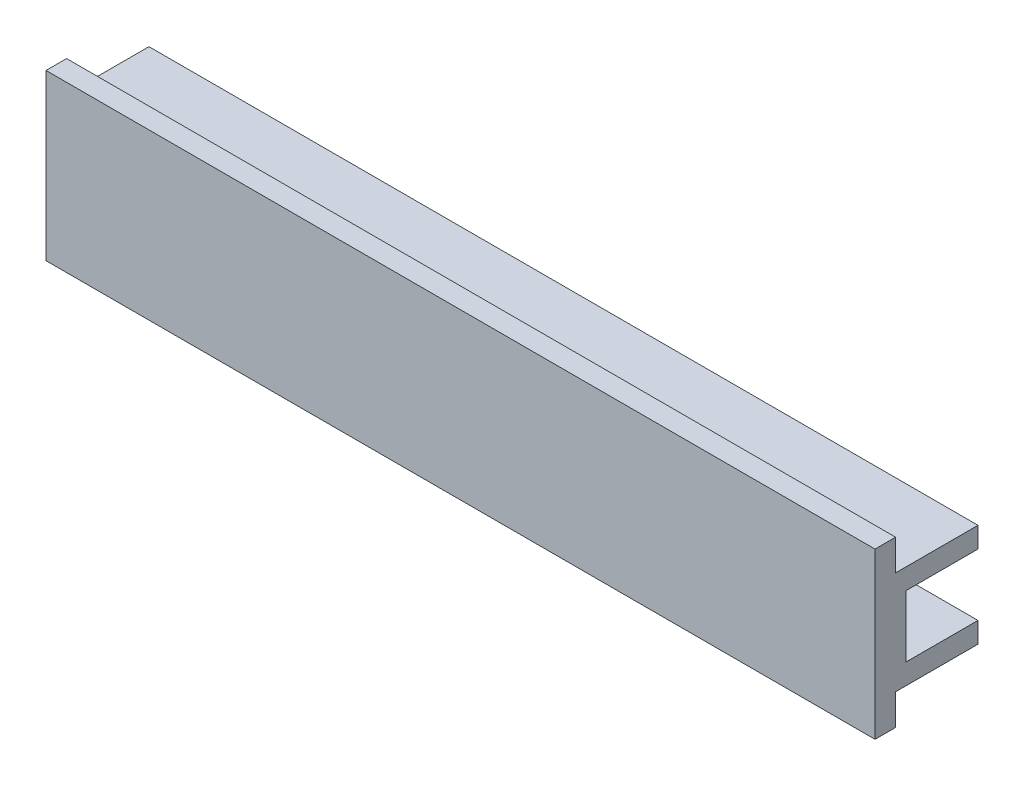
ISO-10303-21;
HEADER;
FILE_DESCRIPTION(('STEP AP214'),'2;1');
FILE_NAME('part.step','',(''),(''),'','','');
FILE_SCHEMA(('AUTOMOTIVE_DESIGN { 1 0 10303 214 1 1 1 1 }'));
ENDSEC;
DATA;
#1=APPLICATION_CONTEXT('core data for automotive mechanical design processes');
#2=APPLICATION_PROTOCOL_DEFINITION('international standard','automotive_design',2000,#1);
#3=PRODUCT_CONTEXT('',#1,'mechanical');
#4=PRODUCT('Part','Part','',(#3));
#5=PRODUCT_RELATED_PRODUCT_CATEGORY('part','',(#4));
#6=PRODUCT_DEFINITION_FORMATION('','',#4);
#7=PRODUCT_DEFINITION_CONTEXT('part definition',#1,'design');
#8=PRODUCT_DEFINITION('design','',#6,#7);
#9=PRODUCT_DEFINITION_SHAPE('','',#8);
#10=(LENGTH_UNIT() NAMED_UNIT(*) SI_UNIT(.MILLI.,.METRE.));
#11=(NAMED_UNIT(*) PLANE_ANGLE_UNIT() SI_UNIT($,.RADIAN.));
#12=(NAMED_UNIT(*) SI_UNIT($,.STERADIAN.) SOLID_ANGLE_UNIT());
#13=UNCERTAINTY_MEASURE_WITH_UNIT(LENGTH_MEASURE(1.E-05),#10,'distance_accuracy_value','');
#14=(GEOMETRIC_REPRESENTATION_CONTEXT(3) GLOBAL_UNCERTAINTY_ASSIGNED_CONTEXT((#13)) GLOBAL_UNIT_ASSIGNED_CONTEXT((#10,
#11,#12)) REPRESENTATION_CONTEXT('',''));
#15=CARTESIAN_POINT('',(0.,0.,0.));
#16=DIRECTION('',(0.,0.,1.));
#17=DIRECTION('',(1.,0.,0.));
#18=AXIS2_PLACEMENT_3D('',#15,#16,#17);
#19=CARTESIAN_POINT('',(40.25,8.,5.));
#20=DIRECTION('',(0.,0.,-1.));
#21=DIRECTION('',(-1.,0.,0.));
#22=AXIS2_PLACEMENT_3D('',#19,#20,#21);
#23=PLANE('',#22);
#24=DIRECTION('',(0.,-1.,0.));
#25=VECTOR('',#24,1.);
#26=CARTESIAN_POINT('',(-40.25,8.,5.));
#27=LINE('',#26,#25);
#28=CARTESIAN_POINT('',(-40.25,8.,5.));
#29=VERTEX_POINT('',#28);
#30=CARTESIAN_POINT('',(-40.25,-8.,5.));
#31=VERTEX_POINT('',#30);
#32=EDGE_CURVE('E150',#29,#31,#27,.T.);
#33=ORIENTED_EDGE('',*,*,#32,.T.);
#34=DIRECTION('',(-1.,0.,0.));
#35=VECTOR('',#34,1.);
#36=CARTESIAN_POINT('',(40.25,-8.,5.));
#37=LINE('',#36,#35);
#38=CARTESIAN_POINT('',(40.25,-8.,5.));
#39=VERTEX_POINT('',#38);
#40=EDGE_CURVE('E11',#39,#31,#37,.T.);
#41=ORIENTED_EDGE('',*,*,#40,.F.);
#42=DIRECTION('',(0.,-1.,0.));
#43=VECTOR('',#42,1.);
#44=CARTESIAN_POINT('',(40.25,8.,5.));
#45=LINE('',#44,#43);
#46=CARTESIAN_POINT('',(40.25,8.,5.));
#47=VERTEX_POINT('',#46);
#48=EDGE_CURVE('E172',#47,#39,#45,.T.);
#49=ORIENTED_EDGE('',*,*,#48,.F.);
#50=DIRECTION('',(-1.,0.,0.));
#51=VECTOR('',#50,1.);
#52=CARTESIAN_POINT('',(40.25,8.,5.));
#53=LINE('',#52,#51);
#54=EDGE_CURVE('E146',#47,#29,#53,.T.);
#55=ORIENTED_EDGE('',*,*,#54,.T.);
#56=EDGE_LOOP('',(#33,#41,#49,#55));
#57=FACE_BOUND('',#56,.T.);
#58=ADVANCED_FACE('F32',(#57),#23,.F.);
#59=CARTESIAN_POINT('',(40.25,-8.,5.));
#60=DIRECTION('',(0.,1.,0.));
#61=DIRECTION('',(0.,0.,1.));
#62=AXIS2_PLACEMENT_3D('',#59,#60,#61);
#63=PLANE('',#62);
#64=DIRECTION('',(0.,0.,-1.));
#65=VECTOR('',#64,1.);
#66=CARTESIAN_POINT('',(-40.25,-8.,5.));
#67=LINE('',#66,#65);
#68=CARTESIAN_POINT('',(-40.25,-8.,3.));
#69=VERTEX_POINT('',#68);
#70=EDGE_CURVE('E153',#31,#69,#67,.T.);
#71=ORIENTED_EDGE('',*,*,#70,.T.);
#72=DIRECTION('',(-1.,0.,0.));
#73=VECTOR('',#72,1.);
#74=CARTESIAN_POINT('',(40.25,-8.,3.));
#75=LINE('',#74,#73);
#76=CARTESIAN_POINT('',(40.25,-8.,3.));
#77=VERTEX_POINT('',#76);
#78=EDGE_CURVE('E40',#77,#69,#75,.T.);
#79=ORIENTED_EDGE('',*,*,#78,.F.);
#80=DIRECTION('',(0.,0.,-1.));
#81=VECTOR('',#80,1.);
#82=CARTESIAN_POINT('',(40.25,-8.,5.));
#83=LINE('',#82,#81);
#84=EDGE_CURVE('E98',#39,#77,#83,.T.);
#85=ORIENTED_EDGE('',*,*,#84,.F.);
#86=ORIENTED_EDGE('',*,*,#40,.T.);
#87=EDGE_LOOP('',(#71,#79,#85,#86));
#88=FACE_BOUND('',#87,.T.);
#89=ADVANCED_FACE('F251',(#88),#63,.F.);
#90=CARTESIAN_POINT('',(40.25,-5.,3.));
#91=DIRECTION('',(0.,0.,1.));
#92=DIRECTION('',(0.,-1.,0.));
#93=AXIS2_PLACEMENT_3D('',#90,#91,#92);
#94=PLANE('',#93);
#95=DIRECTION('',(0.,1.,0.));
#96=VECTOR('',#95,1.);
#97=CARTESIAN_POINT('',(-40.25,-5.,3.));
#98=LINE('',#97,#96);
#99=CARTESIAN_POINT('',(-40.25,-5.,3.));
#100=VERTEX_POINT('',#99);
#101=EDGE_CURVE('E156',#69,#100,#98,.T.);
#102=ORIENTED_EDGE('',*,*,#101,.T.);
#103=DIRECTION('',(-1.,0.,0.));
#104=VECTOR('',#103,1.);
#105=CARTESIAN_POINT('',(40.25,-5.,3.));
#106=LINE('',#105,#104);
#107=CARTESIAN_POINT('',(40.25,-5.,3.));
#108=VERTEX_POINT('',#107);
#109=EDGE_CURVE('E191',#108,#100,#106,.T.);
#110=ORIENTED_EDGE('',*,*,#109,.F.);
#111=DIRECTION('',(0.,1.,0.));
#112=VECTOR('',#111,1.);
#113=CARTESIAN_POINT('',(40.25,-5.,3.));
#114=LINE('',#113,#112);
#115=EDGE_CURVE('E199',#77,#108,#114,.T.);
#116=ORIENTED_EDGE('',*,*,#115,.F.);
#117=ORIENTED_EDGE('',*,*,#78,.T.);
#118=EDGE_LOOP('',(#102,#110,#116,#117));
#119=FACE_BOUND('',#118,.T.);
#120=ADVANCED_FACE('F197',(#119),#94,.F.);
#121=CARTESIAN_POINT('',(40.25,-5.,-5.));
#122=DIRECTION('',(0.,1.,0.));
#123=DIRECTION('',(0.,0.,1.));
#124=AXIS2_PLACEMENT_3D('',#121,#122,#123);
#125=PLANE('',#124);
#126=DIRECTION('',(0.,0.,-1.));
#127=VECTOR('',#126,1.);
#128=CARTESIAN_POINT('',(-40.25,-5.,-5.));
#129=LINE('',#128,#127);
#130=CARTESIAN_POINT('',(-40.25,-5.,-5.));
#131=VERTEX_POINT('',#130);
#132=EDGE_CURVE('E158',#100,#131,#129,.T.);
#133=ORIENTED_EDGE('',*,*,#132,.T.);
#134=DIRECTION('',(-1.,0.,0.));
#135=VECTOR('',#134,1.);
#136=CARTESIAN_POINT('',(40.25,-5.,-5.));
#137=LINE('',#136,#135);
#138=CARTESIAN_POINT('',(40.25,-5.,-5.));
#139=VERTEX_POINT('',#138);
#140=EDGE_CURVE('E188',#139,#131,#137,.T.);
#141=ORIENTED_EDGE('',*,*,#140,.F.);
#142=DIRECTION('',(0.,0.,-1.));
#143=VECTOR('',#142,1.);
#144=CARTESIAN_POINT('',(40.25,-5.,-5.));
#145=LINE('',#144,#143);
#146=EDGE_CURVE('E218',#108,#139,#145,.T.);
#147=ORIENTED_EDGE('',*,*,#146,.F.);
#148=ORIENTED_EDGE('',*,*,#109,.T.);
#149=EDGE_LOOP('',(#133,#141,#147,#148));
#150=FACE_BOUND('',#149,.T.);
#151=ADVANCED_FACE('F209',(#150),#125,.F.);
#152=CARTESIAN_POINT('',(40.25,-3.,-5.));
#153=DIRECTION('',(0.,0.,1.));
#154=DIRECTION('',(1.,0.,0.));
#155=AXIS2_PLACEMENT_3D('',#152,#153,#154);
#156=PLANE('',#155);
#157=DIRECTION('',(0.,1.,0.));
#158=VECTOR('',#157,1.);
#159=CARTESIAN_POINT('',(-40.25,-3.,-5.));
#160=LINE('',#159,#158);
#161=CARTESIAN_POINT('',(-40.25,-3.,-5.));
#162=VERTEX_POINT('',#161);
#163=EDGE_CURVE('E160',#131,#162,#160,.T.);
#164=ORIENTED_EDGE('',*,*,#163,.T.);
#165=DIRECTION('',(-1.,0.,0.));
#166=VECTOR('',#165,1.);
#167=CARTESIAN_POINT('',(40.25,-3.,-5.));
#168=LINE('',#167,#166);
#169=CARTESIAN_POINT('',(40.25,-3.,-5.));
#170=VERTEX_POINT('',#169);
#171=EDGE_CURVE('E185',#170,#162,#168,.T.);
#172=ORIENTED_EDGE('',*,*,#171,.F.);
#173=DIRECTION('',(0.,1.,0.));
#174=VECTOR('',#173,1.);
#175=CARTESIAN_POINT('',(40.25,-3.,-5.));
#176=LINE('',#175,#174);
#177=EDGE_CURVE('E215',#139,#170,#176,.T.);
#178=ORIENTED_EDGE('',*,*,#177,.F.);
#179=ORIENTED_EDGE('',*,*,#140,.T.);
#180=EDGE_LOOP('',(#164,#172,#178,#179));
#181=FACE_BOUND('',#180,.T.);
#182=ADVANCED_FACE('F213',(#181),#156,.F.);
#183=CARTESIAN_POINT('',(40.25,-3.,2.));
#184=DIRECTION('',(0.,-1.,0.));
#185=DIRECTION('',(0.,0.,-1.));
#186=AXIS2_PLACEMENT_3D('',#183,#184,#185);
#187=PLANE('',#186);
#188=DIRECTION('',(0.,0.,1.));
#189=VECTOR('',#188,1.);
#190=CARTESIAN_POINT('',(-40.25,-3.,2.));
#191=LINE('',#190,#189);
#192=CARTESIAN_POINT('',(-40.25,-3.,3.));
#193=VERTEX_POINT('',#192);
#194=EDGE_CURVE('E162',#162,#193,#191,.T.);
#195=ORIENTED_EDGE('',*,*,#194,.T.);
#196=DIRECTION('',(-1.,0.,0.));
#197=VECTOR('',#196,1.);
#198=CARTESIAN_POINT('',(-18.25,-3.,3.));
#199=LINE('',#198,#197);
#200=CARTESIAN_POINT('',(-18.25,-3.,3.));
#201=VERTEX_POINT('',#200);
#202=EDGE_CURVE('E363',#201,#193,#199,.T.);
#203=ORIENTED_EDGE('',*,*,#202,.F.);
#204=DIRECTION('',(0.,0.,1.));
#205=VECTOR('',#204,1.);
#206=CARTESIAN_POINT('',(-18.25,-3.,3.));
#207=LINE('',#206,#205);
#208=CARTESIAN_POINT('',(-18.25,-3.,2.));
#209=VERTEX_POINT('',#208);
#210=EDGE_CURVE('E364',#209,#201,#207,.T.);
#211=ORIENTED_EDGE('',*,*,#210,.F.);
#212=DIRECTION('',(-1.,0.,0.));
#213=VECTOR('',#212,1.);
#214=CARTESIAN_POINT('',(40.25,-3.,2.));
#215=LINE('',#214,#213);
#216=CARTESIAN_POINT('',(40.25,-3.,2.));
#217=VERTEX_POINT('',#216);
#218=EDGE_CURVE('E182',#217,#209,#215,.T.);
#219=ORIENTED_EDGE('',*,*,#218,.F.);
#220=DIRECTION('',(0.,0.,1.));
#221=VECTOR('',#220,1.);
#222=CARTESIAN_POINT('',(40.25,-3.,2.));
#223=LINE('',#222,#221);
#224=EDGE_CURVE('E217',#170,#217,#223,.T.);
#225=ORIENTED_EDGE('',*,*,#224,.F.);
#226=ORIENTED_EDGE('',*,*,#171,.T.);
#227=EDGE_LOOP('',(#195,#203,#211,#219,#225,#226));
#228=FACE_BOUND('',#227,.T.);
#229=ADVANCED_FACE('F264',(#228),#187,.F.);
#230=CARTESIAN_POINT('',(40.25,3.,2.));
#231=DIRECTION('',(0.,0.,1.));
#232=DIRECTION('',(0.,-1.,0.));
#233=AXIS2_PLACEMENT_3D('',#230,#231,#232);
#234=PLANE('',#233);
#235=ORIENTED_EDGE('',*,*,#218,.T.);
#236=CARTESIAN_POINT('',(-18.25,0.,2.));
#237=DIRECTION('',(0.,0.,-1.));
#238=DIRECTION('',(0.,1.,0.));
#239=AXIS2_PLACEMENT_3D('',#236,#237,#238);
#240=CIRCLE('',#239,3.);
#241=CARTESIAN_POINT('',(-18.25,3.,2.));
#242=VERTEX_POINT('',#241);
#243=EDGE_CURVE('E356',#242,#209,#240,.T.);
#244=ORIENTED_EDGE('',*,*,#243,.F.);
#245=DIRECTION('',(-1.,0.,0.));
#246=VECTOR('',#245,1.);
#247=CARTESIAN_POINT('',(40.25,3.,2.));
#248=LINE('',#247,#246);
#249=CARTESIAN_POINT('',(40.25,3.,2.));
#250=VERTEX_POINT('',#249);
#251=EDGE_CURVE('E179',#250,#242,#248,.T.);
#252=ORIENTED_EDGE('',*,*,#251,.F.);
#253=DIRECTION('',(0.,1.,0.));
#254=VECTOR('',#253,1.);
#255=CARTESIAN_POINT('',(40.25,3.,2.));
#256=LINE('',#255,#254);
#257=EDGE_CURVE('E220',#217,#250,#256,.T.);
#258=ORIENTED_EDGE('',*,*,#257,.F.);
#259=EDGE_LOOP('',(#235,#244,#252,#258));
#260=FACE_BOUND('',#259,.T.);
#261=ADVANCED_FACE('F267',(#260),#234,.F.);
#262=CARTESIAN_POINT('',(40.25,3.,-5.));
#263=DIRECTION('',(0.,1.,0.));
#264=DIRECTION('',(0.,0.,1.));
#265=AXIS2_PLACEMENT_3D('',#262,#263,#264);
#266=PLANE('',#265);
#267=DIRECTION('',(0.,0.,-1.));
#268=VECTOR('',#267,1.);
#269=CARTESIAN_POINT('',(-40.25,3.,-5.));
#270=LINE('',#269,#268);
#271=CARTESIAN_POINT('',(-40.25,3.,3.));
#272=VERTEX_POINT('',#271);
#273=CARTESIAN_POINT('',(-40.25,3.,-5.));
#274=VERTEX_POINT('',#273);
#275=EDGE_CURVE('E165',#272,#274,#270,.T.);
#276=ORIENTED_EDGE('',*,*,#275,.T.);
#277=DIRECTION('',(-1.,0.,0.));
#278=VECTOR('',#277,1.);
#279=CARTESIAN_POINT('',(40.25,3.,-5.));
#280=LINE('',#279,#278);
#281=CARTESIAN_POINT('',(40.25,3.,-5.));
#282=VERTEX_POINT('',#281);
#283=EDGE_CURVE('E176',#282,#274,#280,.T.);
#284=ORIENTED_EDGE('',*,*,#283,.F.);
#285=DIRECTION('',(0.,0.,-1.));
#286=VECTOR('',#285,1.);
#287=CARTESIAN_POINT('',(40.25,3.,-5.));
#288=LINE('',#287,#286);
#289=EDGE_CURVE('E226',#250,#282,#288,.T.);
#290=ORIENTED_EDGE('',*,*,#289,.F.);
#291=ORIENTED_EDGE('',*,*,#251,.T.);
#292=DIRECTION('',(0.,0.,-1.));
#293=VECTOR('',#292,1.);
#294=CARTESIAN_POINT('',(-18.25,3.,2.));
#295=LINE('',#294,#293);
#296=CARTESIAN_POINT('',(-18.25,3.,3.));
#297=VERTEX_POINT('',#296);
#298=EDGE_CURVE('E352',#297,#242,#295,.T.);
#299=ORIENTED_EDGE('',*,*,#298,.F.);
#300=DIRECTION('',(-1.,0.,0.));
#301=VECTOR('',#300,1.);
#302=CARTESIAN_POINT('',(-18.25,3.,3.));
#303=LINE('',#302,#301);
#304=EDGE_CURVE('E154',#297,#272,#303,.T.);
#305=ORIENTED_EDGE('',*,*,#304,.T.);
#306=EDGE_LOOP('',(#276,#284,#290,#291,#299,#305));
#307=FACE_BOUND('',#306,.T.);
#308=ADVANCED_FACE('F232',(#307),#266,.F.);
#309=CARTESIAN_POINT('',(40.25,5.,-5.));
#310=DIRECTION('',(0.,0.,1.));
#311=DIRECTION('',(1.,0.,0.));
#312=AXIS2_PLACEMENT_3D('',#309,#310,#311);
#313=PLANE('',#312);
#314=DIRECTION('',(0.,1.,0.));
#315=VECTOR('',#314,1.);
#316=CARTESIAN_POINT('',(-40.25,5.,-5.));
#317=LINE('',#316,#315);
#318=CARTESIAN_POINT('',(-40.25,5.,-5.));
#319=VERTEX_POINT('',#318);
#320=EDGE_CURVE('E167',#274,#319,#317,.T.);
#321=ORIENTED_EDGE('',*,*,#320,.T.);
#322=DIRECTION('',(-1.,0.,0.));
#323=VECTOR('',#322,1.);
#324=CARTESIAN_POINT('',(40.25,5.,-5.));
#325=LINE('',#324,#323);
#326=CARTESIAN_POINT('',(40.25,5.,-5.));
#327=VERTEX_POINT('',#326);
#328=EDGE_CURVE('E141',#327,#319,#325,.T.);
#329=ORIENTED_EDGE('',*,*,#328,.F.);
#330=DIRECTION('',(0.,1.,0.));
#331=VECTOR('',#330,1.);
#332=CARTESIAN_POINT('',(40.25,5.,-5.));
#333=LINE('',#332,#331);
#334=EDGE_CURVE('E132',#282,#327,#333,.T.);
#335=ORIENTED_EDGE('',*,*,#334,.F.);
#336=ORIENTED_EDGE('',*,*,#283,.T.);
#337=EDGE_LOOP('',(#321,#329,#335,#336));
#338=FACE_BOUND('',#337,.T.);
#339=ADVANCED_FACE('F236',(#338),#313,.F.);
#340=CARTESIAN_POINT('',(40.25,5.,3.));
#341=DIRECTION('',(0.,-1.,0.));
#342=DIRECTION('',(0.,0.,-1.));
#343=AXIS2_PLACEMENT_3D('',#340,#341,#342);
#344=PLANE('',#343);
#345=DIRECTION('',(0.,0.,1.));
#346=VECTOR('',#345,1.);
#347=CARTESIAN_POINT('',(-40.25,5.,3.));
#348=LINE('',#347,#346);
#349=CARTESIAN_POINT('',(-40.25,5.,3.));
#350=VERTEX_POINT('',#349);
#351=EDGE_CURVE('E140',#319,#350,#348,.T.);
#352=ORIENTED_EDGE('',*,*,#351,.T.);
#353=DIRECTION('',(-1.,0.,0.));
#354=VECTOR('',#353,1.);
#355=CARTESIAN_POINT('',(40.25,5.,3.));
#356=LINE('',#355,#354);
#357=CARTESIAN_POINT('',(40.25,5.,3.));
#358=VERTEX_POINT('',#357);
#359=EDGE_CURVE('E137',#358,#350,#356,.T.);
#360=ORIENTED_EDGE('',*,*,#359,.F.);
#361=DIRECTION('',(0.,0.,1.));
#362=VECTOR('',#361,1.);
#363=CARTESIAN_POINT('',(40.25,5.,3.));
#364=LINE('',#363,#362);
#365=EDGE_CURVE('E126',#327,#358,#364,.T.);
#366=ORIENTED_EDGE('',*,*,#365,.F.);
#367=ORIENTED_EDGE('',*,*,#328,.T.);
#368=EDGE_LOOP('',(#352,#360,#366,#367));
#369=FACE_BOUND('',#368,.T.);
#370=ADVANCED_FACE('F138',(#369),#344,.F.);
#371=CARTESIAN_POINT('',(40.25,8.,3.));
#372=DIRECTION('',(0.,0.,1.));
#373=DIRECTION('',(0.,-1.,0.));
#374=AXIS2_PLACEMENT_3D('',#371,#372,#373);
#375=PLANE('',#374);
#376=DIRECTION('',(0.,1.,0.));
#377=VECTOR('',#376,1.);
#378=CARTESIAN_POINT('',(-40.25,8.,3.));
#379=LINE('',#378,#377);
#380=CARTESIAN_POINT('',(-40.25,8.,3.));
#381=VERTEX_POINT('',#380);
#382=EDGE_CURVE('E84',#350,#381,#379,.T.);
#383=ORIENTED_EDGE('',*,*,#382,.T.);
#384=DIRECTION('',(-1.,0.,0.));
#385=VECTOR('',#384,1.);
#386=CARTESIAN_POINT('',(40.25,8.,3.));
#387=LINE('',#386,#385);
#388=CARTESIAN_POINT('',(40.25,8.,3.));
#389=VERTEX_POINT('',#388);
#390=EDGE_CURVE('E142',#389,#381,#387,.T.);
#391=ORIENTED_EDGE('',*,*,#390,.F.);
#392=DIRECTION('',(0.,1.,0.));
#393=VECTOR('',#392,1.);
#394=CARTESIAN_POINT('',(40.25,8.,3.));
#395=LINE('',#394,#393);
#396=EDGE_CURVE('E130',#358,#389,#395,.T.);
#397=ORIENTED_EDGE('',*,*,#396,.F.);
#398=ORIENTED_EDGE('',*,*,#359,.T.);
#399=EDGE_LOOP('',(#383,#391,#397,#398));
#400=FACE_BOUND('',#399,.T.);
#401=ADVANCED_FACE('F144',(#400),#375,.F.);
#402=CARTESIAN_POINT('',(40.25,8.,5.));
#403=DIRECTION('',(0.,-1.,0.));
#404=DIRECTION('',(0.,0.,-1.));
#405=AXIS2_PLACEMENT_3D('',#402,#403,#404);
#406=PLANE('',#405);
#407=DIRECTION('',(0.,0.,1.));
#408=VECTOR('',#407,1.);
#409=CARTESIAN_POINT('',(-40.25,8.,5.));
#410=LINE('',#409,#408);
#411=EDGE_CURVE('E90',#381,#29,#410,.T.);
#412=ORIENTED_EDGE('',*,*,#411,.T.);
#413=ORIENTED_EDGE('',*,*,#54,.F.);
#414=DIRECTION('',(0.,0.,1.));
#415=VECTOR('',#414,1.);
#416=CARTESIAN_POINT('',(40.25,8.,5.));
#417=LINE('',#416,#415);
#418=EDGE_CURVE('E48',#389,#47,#417,.T.);
#419=ORIENTED_EDGE('',*,*,#418,.F.);
#420=ORIENTED_EDGE('',*,*,#390,.T.);
#421=EDGE_LOOP('',(#412,#413,#419,#420));
#422=FACE_BOUND('',#421,.T.);
#423=ADVANCED_FACE('F240',(#422),#406,.F.);
#424=CARTESIAN_POINT('',(40.25,-8.,5.));
#425=DIRECTION('',(1.,0.,0.));
#426=DIRECTION('',(0.,0.,-1.));
#427=AXIS2_PLACEMENT_3D('',#424,#425,#426);
#428=PLANE('',#427);
#429=ORIENTED_EDGE('',*,*,#48,.T.);
#430=ORIENTED_EDGE('',*,*,#84,.T.);
#431=ORIENTED_EDGE('',*,*,#115,.T.);
#432=ORIENTED_EDGE('',*,*,#146,.T.);
#433=ORIENTED_EDGE('',*,*,#177,.T.);
#434=ORIENTED_EDGE('',*,*,#224,.T.);
#435=ORIENTED_EDGE('',*,*,#257,.T.);
#436=ORIENTED_EDGE('',*,*,#289,.T.);
#437=ORIENTED_EDGE('',*,*,#334,.T.);
#438=ORIENTED_EDGE('',*,*,#365,.T.);
#439=ORIENTED_EDGE('',*,*,#396,.T.);
#440=ORIENTED_EDGE('',*,*,#418,.T.);
#441=EDGE_LOOP('',(#429,#430,#431,#432,#433,#434,#435,#436,#437,#438,#439,#440));
#442=FACE_BOUND('',#441,.T.);
#443=ADVANCED_FACE('F128',(#442),#428,.T.);
#444=CARTESIAN_POINT('',(-40.25,-8.,5.));
#445=DIRECTION('',(1.,0.,0.));
#446=DIRECTION('',(0.,0.,-1.));
#447=AXIS2_PLACEMENT_3D('',#444,#445,#446);
#448=PLANE('',#447);
#449=ORIENTED_EDGE('',*,*,#275,.F.);
#450=DIRECTION('',(0.,1.,0.));
#451=VECTOR('',#450,1.);
#452=CARTESIAN_POINT('',(-40.25,3.,3.));
#453=LINE('',#452,#451);
#454=EDGE_CURVE('E368',#193,#272,#453,.T.);
#455=ORIENTED_EDGE('',*,*,#454,.F.);
#456=ORIENTED_EDGE('',*,*,#194,.F.);
#457=ORIENTED_EDGE('',*,*,#163,.F.);
#458=ORIENTED_EDGE('',*,*,#132,.F.);
#459=ORIENTED_EDGE('',*,*,#101,.F.);
#460=ORIENTED_EDGE('',*,*,#70,.F.);
#461=ORIENTED_EDGE('',*,*,#32,.F.);
#462=ORIENTED_EDGE('',*,*,#411,.F.);
#463=ORIENTED_EDGE('',*,*,#382,.F.);
#464=ORIENTED_EDGE('',*,*,#351,.F.);
#465=ORIENTED_EDGE('',*,*,#320,.F.);
#466=EDGE_LOOP('',(#449,#455,#456,#457,#458,#459,#460,#461,#462,#463,#464,#465));
#467=FACE_BOUND('',#466,.T.);
#468=ADVANCED_FACE('F203',(#467),#448,.F.);
#469=CARTESIAN_POINT('',(-18.25,3.,3.));
#470=DIRECTION('',(0.,0.,1.));
#471=DIRECTION('',(0.,-1.,0.));
#472=AXIS2_PLACEMENT_3D('',#469,#470,#471);
#473=PLANE('',#472);
#474=ORIENTED_EDGE('',*,*,#454,.T.);
#475=ORIENTED_EDGE('',*,*,#304,.F.);
#476=CARTESIAN_POINT('',(-18.25,0.,3.));
#477=DIRECTION('',(0.,0.,1.));
#478=DIRECTION('',(0.,-1.,0.));
#479=AXIS2_PLACEMENT_3D('',#476,#477,#478);
#480=CIRCLE('',#479,3.);
#481=EDGE_CURVE('E359',#297,#201,#480,.F.);
#482=ORIENTED_EDGE('',*,*,#481,.T.);
#483=ORIENTED_EDGE('',*,*,#202,.T.);
#484=EDGE_LOOP('',(#474,#475,#482,#483));
#485=FACE_BOUND('',#484,.T.);
#486=ADVANCED_FACE('F304',(#485),#473,.F.);
#487=CARTESIAN_POINT('',(-18.25,0.,9.70820393249937));
#488=DIRECTION('',(0.,0.,-1.));
#489=DIRECTION('',(0.,1.,0.));
#490=AXIS2_PLACEMENT_3D('',#487,#488,#489);
#491=CYLINDRICAL_SURFACE('',#490,3.);
#492=ORIENTED_EDGE('',*,*,#298,.T.);
#493=ORIENTED_EDGE('',*,*,#243,.T.);
#494=ORIENTED_EDGE('',*,*,#210,.T.);
#495=ORIENTED_EDGE('',*,*,#481,.F.);
#496=EDGE_LOOP('',(#492,#493,#494,#495));
#497=FACE_BOUND('',#496,.T.);
#498=ADVANCED_FACE('F333',(#497),#491,.F.);
#499=CLOSED_SHELL('',(#58,#89,#120,#151,#182,#229,#261,#308,#339,#370,#401,#423,#443,#468,#486,#498));
#500=MANIFOLD_SOLID_BREP('B2',#499);
#501=ADVANCED_BREP_SHAPE_REPRESENTATION('',(#18,#500),#14);
#502=SHAPE_DEFINITION_REPRESENTATION(#9,#501);
ENDSEC;
END-ISO-10303-21;
